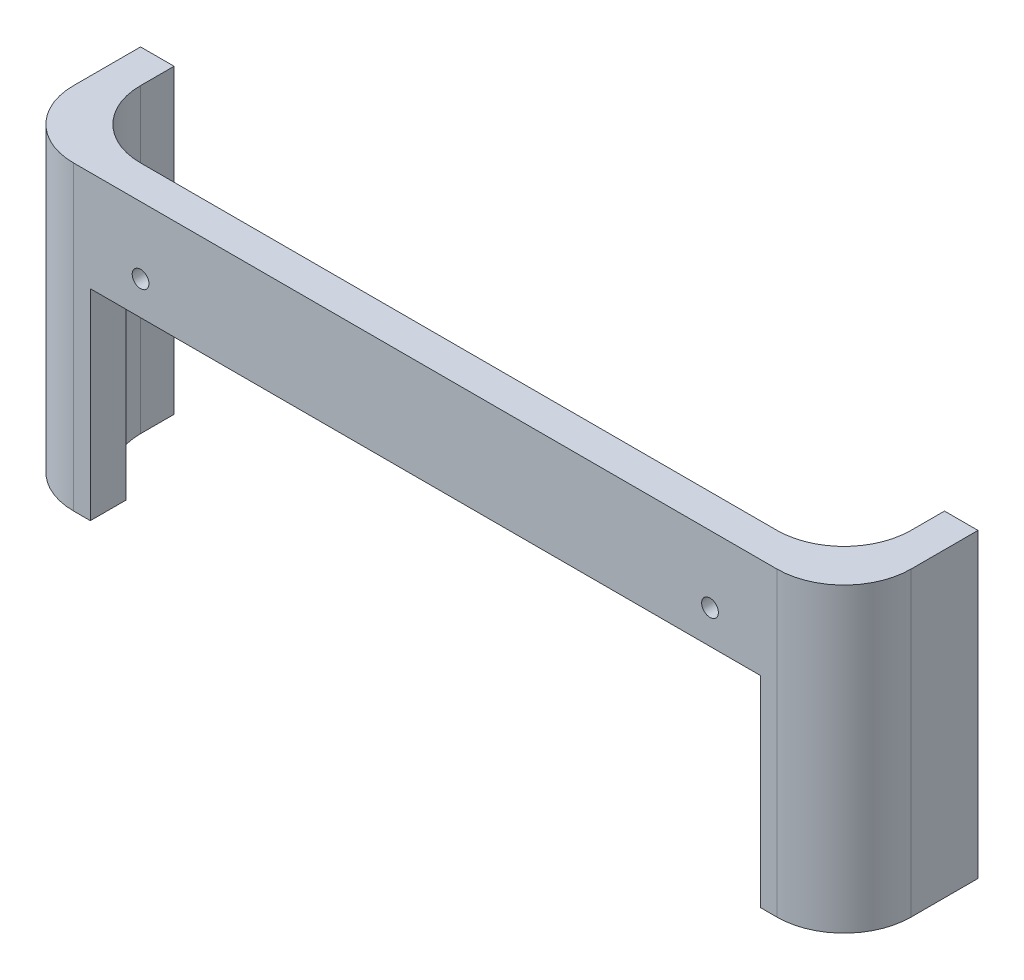
ISO-10303-21;
HEADER;
FILE_DESCRIPTION(('STEP AP214'),'2;1');
FILE_NAME('part.step','',(''),(''),'','','');
FILE_SCHEMA(('AUTOMOTIVE_DESIGN { 1 0 10303 214 1 1 1 1 }'));
ENDSEC;
DATA;
#1=APPLICATION_CONTEXT('core data for automotive mechanical design processes');
#2=APPLICATION_PROTOCOL_DEFINITION('international standard','automotive_design',2000,#1);
#3=PRODUCT_CONTEXT('',#1,'mechanical');
#4=PRODUCT('Part','Part','',(#3));
#5=PRODUCT_RELATED_PRODUCT_CATEGORY('part','',(#4));
#6=PRODUCT_DEFINITION_FORMATION('','',#4);
#7=PRODUCT_DEFINITION_CONTEXT('part definition',#1,'design');
#8=PRODUCT_DEFINITION('design','',#6,#7);
#9=PRODUCT_DEFINITION_SHAPE('','',#8);
#10=(LENGTH_UNIT() NAMED_UNIT(*) SI_UNIT(.MILLI.,.METRE.));
#11=(NAMED_UNIT(*) PLANE_ANGLE_UNIT() SI_UNIT($,.RADIAN.));
#12=(NAMED_UNIT(*) SI_UNIT($,.STERADIAN.) SOLID_ANGLE_UNIT());
#13=UNCERTAINTY_MEASURE_WITH_UNIT(LENGTH_MEASURE(1.E-05),#10,'distance_accuracy_value','');
#14=(GEOMETRIC_REPRESENTATION_CONTEXT(3) GLOBAL_UNCERTAINTY_ASSIGNED_CONTEXT((#13)) GLOBAL_UNIT_ASSIGNED_CONTEXT((#10,
#11,#12)) REPRESENTATION_CONTEXT('',''));
#15=CARTESIAN_POINT('',(0.,0.,0.));
#16=DIRECTION('',(0.,0.,1.));
#17=DIRECTION('',(1.,0.,0.));
#18=AXIS2_PLACEMENT_3D('',#15,#16,#17);
#19=CARTESIAN_POINT('',(0.,0.,0.));
#20=DIRECTION('',(0.,-1.,0.));
#21=DIRECTION('',(0.,0.,-1.));
#22=AXIS2_PLACEMENT_3D('',#19,#20,#21);
#23=PLANE('',#22);
#24=DIRECTION('',(1.,0.,0.));
#25=VECTOR('',#24,1.);
#26=CARTESIAN_POINT('',(-125.,0.,85.));
#27=LINE('',#26,#25);
#28=CARTESIAN_POINT('',(115.,0.,85.));
#29=VERTEX_POINT('',#28);
#30=CARTESIAN_POINT('',(125.,0.,85.));
#31=VERTEX_POINT('',#30);
#32=EDGE_CURVE('E55',#29,#31,#27,.T.);
#33=ORIENTED_EDGE('',*,*,#32,.T.);
#34=DIRECTION('',(0.,0.,-1.));
#35=VECTOR('',#34,1.);
#36=CARTESIAN_POINT('',(125.,0.,125.));
#37=LINE('',#36,#35);
#38=CARTESIAN_POINT('',(125.,0.,105.));
#39=VERTEX_POINT('',#38);
#40=EDGE_CURVE('E176',#39,#31,#37,.T.);
#41=ORIENTED_EDGE('',*,*,#40,.F.);
#42=CARTESIAN_POINT('',(105.,0.,105.));
#43=DIRECTION('',(0.,-1.,0.));
#44=DIRECTION('',(0.,0.,-1.));
#45=AXIS2_PLACEMENT_3D('',#42,#43,#44);
#46=CIRCLE('',#45,20.);
#47=CARTESIAN_POINT('',(105.,0.,125.));
#48=VERTEX_POINT('',#47);
#49=EDGE_CURVE('E216',#39,#48,#46,.T.);
#50=ORIENTED_EDGE('',*,*,#49,.T.);
#51=DIRECTION('',(1.,0.,0.));
#52=VECTOR('',#51,1.);
#53=CARTESIAN_POINT('',(-125.,0.,125.));
#54=LINE('',#53,#52);
#55=CARTESIAN_POINT('',(100.,0.,125.));
#56=VERTEX_POINT('',#55);
#57=EDGE_CURVE('E175',#56,#48,#54,.T.);
#58=ORIENTED_EDGE('',*,*,#57,.F.);
#59=DIRECTION('',(0.,0.,1.));
#60=VECTOR('',#59,1.);
#61=CARTESIAN_POINT('',(100.,0.,75.));
#62=LINE('',#61,#60);
#63=CARTESIAN_POINT('',(100.,0.,114.364916731037));
#64=VERTEX_POINT('',#63);
#65=EDGE_CURVE('E356',#64,#56,#62,.T.);
#66=ORIENTED_EDGE('',*,*,#65,.F.);
#67=CARTESIAN_POINT('',(95.,0.,95.));
#68=DIRECTION('',(0.,-1.,0.));
#69=DIRECTION('',(0.,0.,-1.));
#70=AXIS2_PLACEMENT_3D('',#67,#68,#69);
#71=CIRCLE('',#70,20.);
#72=CARTESIAN_POINT('',(115.,0.,95.));
#73=VERTEX_POINT('',#72);
#74=EDGE_CURVE('E257',#64,#73,#71,.F.);
#75=ORIENTED_EDGE('',*,*,#74,.T.);
#76=DIRECTION('',(0.,0.,-1.));
#77=VECTOR('',#76,1.);
#78=CARTESIAN_POINT('',(115.,0.,115.));
#79=LINE('',#78,#77);
#80=EDGE_CURVE('E304',#73,#29,#79,.T.);
#81=ORIENTED_EDGE('',*,*,#80,.T.);
#82=EDGE_LOOP('',(#33,#41,#50,#58,#66,#75,#81));
#83=FACE_BOUND('',#82,.T.);
#84=ADVANCED_FACE('F39',(#83),#23,.T.);
#85=CARTESIAN_POINT('',(0.,90.,0.));
#86=DIRECTION('',(0.,-1.,0.));
#87=DIRECTION('',(0.,0.,-1.));
#88=AXIS2_PLACEMENT_3D('',#85,#86,#87);
#89=PLANE('',#88);
#90=DIRECTION('',(0.,0.,-1.));
#91=VECTOR('',#90,1.);
#92=CARTESIAN_POINT('',(125.,90.,125.));
#93=LINE('',#92,#91);
#94=CARTESIAN_POINT('',(125.,90.,105.));
#95=VERTEX_POINT('',#94);
#96=CARTESIAN_POINT('',(125.,90.,85.));
#97=VERTEX_POINT('',#96);
#98=EDGE_CURVE('E189',#95,#97,#93,.T.);
#99=ORIENTED_EDGE('',*,*,#98,.T.);
#100=DIRECTION('',(1.,0.,0.));
#101=VECTOR('',#100,1.);
#102=CARTESIAN_POINT('',(-125.,90.,85.));
#103=LINE('',#102,#101);
#104=CARTESIAN_POINT('',(115.,90.,85.));
#105=VERTEX_POINT('',#104);
#106=EDGE_CURVE('E158',#105,#97,#103,.T.);
#107=ORIENTED_EDGE('',*,*,#106,.F.);
#108=DIRECTION('',(0.,0.,-1.));
#109=VECTOR('',#108,1.);
#110=CARTESIAN_POINT('',(115.,90.,115.));
#111=LINE('',#110,#109);
#112=CARTESIAN_POINT('',(115.,90.,95.));
#113=VERTEX_POINT('',#112);
#114=EDGE_CURVE('E270',#113,#105,#111,.T.);
#115=ORIENTED_EDGE('',*,*,#114,.F.);
#116=CARTESIAN_POINT('',(95.,90.,95.));
#117=DIRECTION('',(0.,-1.,0.));
#118=DIRECTION('',(0.,0.,-1.));
#119=AXIS2_PLACEMENT_3D('',#116,#117,#118);
#120=CIRCLE('',#119,20.);
#121=CARTESIAN_POINT('',(95.,90.,115.));
#122=VERTEX_POINT('',#121);
#123=EDGE_CURVE('E48',#113,#122,#120,.T.);
#124=ORIENTED_EDGE('',*,*,#123,.T.);
#125=DIRECTION('',(1.,0.,0.));
#126=VECTOR('',#125,1.);
#127=CARTESIAN_POINT('',(-115.,90.,115.));
#128=LINE('',#127,#126);
#129=CARTESIAN_POINT('',(-95.,90.,115.));
#130=VERTEX_POINT('',#129);
#131=EDGE_CURVE('E184',#130,#122,#128,.T.);
#132=ORIENTED_EDGE('',*,*,#131,.F.);
#133=CARTESIAN_POINT('',(-95.,90.,95.));
#134=DIRECTION('',(0.,-1.,0.));
#135=DIRECTION('',(0.,0.,-1.));
#136=AXIS2_PLACEMENT_3D('',#133,#134,#135);
#137=CIRCLE('',#136,20.);
#138=CARTESIAN_POINT('',(-115.,90.,95.));
#139=VERTEX_POINT('',#138);
#140=EDGE_CURVE('E245',#130,#139,#137,.T.);
#141=ORIENTED_EDGE('',*,*,#140,.T.);
#142=DIRECTION('',(0.,0.,1.));
#143=VECTOR('',#142,1.);
#144=CARTESIAN_POINT('',(-115.,90.,115.));
#145=LINE('',#144,#143);
#146=CARTESIAN_POINT('',(-115.,90.,85.));
#147=VERTEX_POINT('',#146);
#148=EDGE_CURVE('E279',#147,#139,#145,.T.);
#149=ORIENTED_EDGE('',*,*,#148,.F.);
#150=CARTESIAN_POINT('',(-125.,90.,85.));
#151=VERTEX_POINT('',#150);
#152=EDGE_CURVE('E62',#151,#147,#103,.T.);
#153=ORIENTED_EDGE('',*,*,#152,.F.);
#154=DIRECTION('',(0.,0.,1.));
#155=VECTOR('',#154,1.);
#156=CARTESIAN_POINT('',(-125.,90.,125.));
#157=LINE('',#156,#155);
#158=CARTESIAN_POINT('',(-125.,90.,105.));
#159=VERTEX_POINT('',#158);
#160=EDGE_CURVE('E166',#151,#159,#157,.T.);
#161=ORIENTED_EDGE('',*,*,#160,.T.);
#162=CARTESIAN_POINT('',(-105.,90.,105.));
#163=DIRECTION('',(0.,-1.,0.));
#164=DIRECTION('',(0.,0.,-1.));
#165=AXIS2_PLACEMENT_3D('',#162,#163,#164);
#166=CIRCLE('',#165,20.);
#167=CARTESIAN_POINT('',(-105.,90.,125.));
#168=VERTEX_POINT('',#167);
#169=EDGE_CURVE('E227',#159,#168,#166,.F.);
#170=ORIENTED_EDGE('',*,*,#169,.T.);
#171=DIRECTION('',(1.,0.,0.));
#172=VECTOR('',#171,1.);
#173=CARTESIAN_POINT('',(-125.,90.,125.));
#174=LINE('',#173,#172);
#175=CARTESIAN_POINT('',(105.,90.,125.));
#176=VERTEX_POINT('',#175);
#177=EDGE_CURVE('E195',#168,#176,#174,.T.);
#178=ORIENTED_EDGE('',*,*,#177,.T.);
#179=CARTESIAN_POINT('',(105.,90.,105.));
#180=DIRECTION('',(0.,-1.,0.));
#181=DIRECTION('',(0.,0.,-1.));
#182=AXIS2_PLACEMENT_3D('',#179,#180,#181);
#183=CIRCLE('',#182,20.);
#184=EDGE_CURVE('E224',#176,#95,#183,.F.);
#185=ORIENTED_EDGE('',*,*,#184,.T.);
#186=EDGE_LOOP('',(#99,#107,#115,#124,#132,#141,#149,#153,#161,#170,#178,#185));
#187=FACE_BOUND('',#186,.T.);
#188=ADVANCED_FACE('F266',(#187),#89,.F.);
#189=CARTESIAN_POINT('',(-125.,0.,85.));
#190=VERTEX_POINT('',#189);
#191=CARTESIAN_POINT('',(-115.,0.,85.));
#192=VERTEX_POINT('',#191);
#193=EDGE_CURVE('E150',#190,#192,#27,.T.);
#194=ORIENTED_EDGE('',*,*,#193,.T.);
#195=DIRECTION('',(0.,0.,1.));
#196=VECTOR('',#195,1.);
#197=CARTESIAN_POINT('',(-115.,0.,115.));
#198=LINE('',#197,#196);
#199=CARTESIAN_POINT('',(-115.,0.,95.));
#200=VERTEX_POINT('',#199);
#201=EDGE_CURVE('E300',#192,#200,#198,.T.);
#202=ORIENTED_EDGE('',*,*,#201,.T.);
#203=CARTESIAN_POINT('',(-95.,0.,95.));
#204=DIRECTION('',(0.,-1.,0.));
#205=DIRECTION('',(0.,0.,-1.));
#206=AXIS2_PLACEMENT_3D('',#203,#204,#205);
#207=CIRCLE('',#206,20.);
#208=CARTESIAN_POINT('',(-100.,0.,114.364916731037));
#209=VERTEX_POINT('',#208);
#210=EDGE_CURVE('E234',#200,#209,#207,.F.);
#211=ORIENTED_EDGE('',*,*,#210,.T.);
#212=DIRECTION('',(0.,0.,1.));
#213=VECTOR('',#212,1.);
#214=CARTESIAN_POINT('',(-100.,0.,75.));
#215=LINE('',#214,#213);
#216=CARTESIAN_POINT('',(-100.,0.,125.));
#217=VERTEX_POINT('',#216);
#218=EDGE_CURVE('E351',#209,#217,#215,.T.);
#219=ORIENTED_EDGE('',*,*,#218,.T.);
#220=CARTESIAN_POINT('',(-105.,0.,125.));
#221=VERTEX_POINT('',#220);
#222=EDGE_CURVE('E181',#221,#217,#54,.T.);
#223=ORIENTED_EDGE('',*,*,#222,.F.);
#224=CARTESIAN_POINT('',(-105.,0.,105.));
#225=DIRECTION('',(0.,-1.,0.));
#226=DIRECTION('',(0.,0.,-1.));
#227=AXIS2_PLACEMENT_3D('',#224,#225,#226);
#228=CIRCLE('',#227,20.);
#229=CARTESIAN_POINT('',(-125.,0.,105.));
#230=VERTEX_POINT('',#229);
#231=EDGE_CURVE('E172',#221,#230,#228,.T.);
#232=ORIENTED_EDGE('',*,*,#231,.T.);
#233=DIRECTION('',(0.,0.,1.));
#234=VECTOR('',#233,1.);
#235=CARTESIAN_POINT('',(-125.,0.,125.));
#236=LINE('',#235,#234);
#237=EDGE_CURVE('E164',#190,#230,#236,.T.);
#238=ORIENTED_EDGE('',*,*,#237,.F.);
#239=EDGE_LOOP('',(#194,#202,#211,#219,#223,#232,#238));
#240=FACE_BOUND('',#239,.T.);
#241=ADVANCED_FACE('F170',(#240),#23,.T.);
#242=CARTESIAN_POINT('',(125.,90.,125.));
#243=DIRECTION('',(-1.,0.,0.));
#244=DIRECTION('',(0.,0.,1.));
#245=AXIS2_PLACEMENT_3D('',#242,#243,#244);
#246=PLANE('',#245);
#247=ORIENTED_EDGE('',*,*,#40,.T.);
#248=DIRECTION('',(0.,1.,0.));
#249=VECTOR('',#248,1.);
#250=CARTESIAN_POINT('',(125.,90.,85.));
#251=LINE('',#250,#249);
#252=EDGE_CURVE('E338',#31,#97,#251,.T.);
#253=ORIENTED_EDGE('',*,*,#252,.T.);
#254=ORIENTED_EDGE('',*,*,#98,.F.);
#255=DIRECTION('',(0.,-1.,0.));
#256=VECTOR('',#255,1.);
#257=CARTESIAN_POINT('',(125.,90.,105.));
#258=LINE('',#257,#256);
#259=EDGE_CURVE('E230',#95,#39,#258,.T.);
#260=ORIENTED_EDGE('',*,*,#259,.T.);
#261=EDGE_LOOP('',(#247,#253,#254,#260));
#262=FACE_BOUND('',#261,.T.);
#263=ADVANCED_FACE('F327',(#262),#246,.F.);
#264=CARTESIAN_POINT('',(-125.,90.,125.));
#265=DIRECTION('',(1.,0.,0.));
#266=DIRECTION('',(0.,0.,-1.));
#267=AXIS2_PLACEMENT_3D('',#264,#265,#266);
#268=PLANE('',#267);
#269=ORIENTED_EDGE('',*,*,#160,.F.);
#270=DIRECTION('',(0.,-1.,0.));
#271=VECTOR('',#270,1.);
#272=CARTESIAN_POINT('',(-125.,0.,85.));
#273=LINE('',#272,#271);
#274=EDGE_CURVE('E153',#151,#190,#273,.T.);
#275=ORIENTED_EDGE('',*,*,#274,.T.);
#276=ORIENTED_EDGE('',*,*,#237,.T.);
#277=DIRECTION('',(0.,-1.,0.));
#278=VECTOR('',#277,1.);
#279=CARTESIAN_POINT('',(-125.,90.,105.));
#280=LINE('',#279,#278);
#281=EDGE_CURVE('E221',#230,#159,#280,.F.);
#282=ORIENTED_EDGE('',*,*,#281,.T.);
#283=EDGE_LOOP('',(#269,#275,#276,#282));
#284=FACE_BOUND('',#283,.T.);
#285=ADVANCED_FACE('F162',(#284),#268,.F.);
#286=CARTESIAN_POINT('',(-125.,90.,125.));
#287=DIRECTION('',(0.,0.,-1.));
#288=DIRECTION('',(-1.,0.,0.));
#289=AXIS2_PLACEMENT_3D('',#286,#287,#288);
#290=PLANE('',#289);
#291=CARTESIAN_POINT('',(-85.,70.,125.));
#292=DIRECTION('',(0.,0.,1.));
#293=DIRECTION('',(1.,0.,0.));
#294=AXIS2_PLACEMENT_3D('',#291,#292,#293);
#295=CIRCLE('',#294,2.50000000000001);
#296=CARTESIAN_POINT('',(-82.5,70.,125.));
#297=VERTEX_POINT('',#296);
#298=EDGE_CURVE('E441',#297,#297,#295,.T.);
#299=ORIENTED_EDGE('',*,*,#298,.F.);
#300=EDGE_LOOP('',(#299));
#301=FACE_BOUND('',#300,.T.);
#302=CARTESIAN_POINT('',(85.,70.,125.));
#303=DIRECTION('',(0.,0.,1.));
#304=DIRECTION('',(1.,0.,0.));
#305=AXIS2_PLACEMENT_3D('',#302,#303,#304);
#306=CIRCLE('',#305,2.50000000000001);
#307=CARTESIAN_POINT('',(87.5,70.,125.));
#308=VERTEX_POINT('',#307);
#309=EDGE_CURVE('E449',#308,#308,#306,.T.);
#310=ORIENTED_EDGE('',*,*,#309,.F.);
#311=EDGE_LOOP('',(#310));
#312=FACE_BOUND('',#311,.T.);
#313=ORIENTED_EDGE('',*,*,#177,.F.);
#314=DIRECTION('',(0.,-1.,0.));
#315=VECTOR('',#314,1.);
#316=CARTESIAN_POINT('',(-105.,90.,125.));
#317=LINE('',#316,#315);
#318=EDGE_CURVE('E212',#168,#221,#317,.T.);
#319=ORIENTED_EDGE('',*,*,#318,.T.);
#320=ORIENTED_EDGE('',*,*,#222,.T.);
#321=DIRECTION('',(0.,-1.,0.));
#322=VECTOR('',#321,1.);
#323=CARTESIAN_POINT('',(-100.,60.,125.));
#324=LINE('',#323,#322);
#325=CARTESIAN_POINT('',(-100.,60.,125.));
#326=VERTEX_POINT('',#325);
#327=EDGE_CURVE('E341',#326,#217,#324,.T.);
#328=ORIENTED_EDGE('',*,*,#327,.F.);
#329=DIRECTION('',(-1.,0.,0.));
#330=VECTOR('',#329,1.);
#331=CARTESIAN_POINT('',(-100.,60.,125.));
#332=LINE('',#331,#330);
#333=CARTESIAN_POINT('',(100.,60.,125.));
#334=VERTEX_POINT('',#333);
#335=EDGE_CURVE('E348',#334,#326,#332,.T.);
#336=ORIENTED_EDGE('',*,*,#335,.F.);
#337=DIRECTION('',(0.,1.,0.));
#338=VECTOR('',#337,1.);
#339=CARTESIAN_POINT('',(100.,60.,125.));
#340=LINE('',#339,#338);
#341=EDGE_CURVE('E345',#56,#334,#340,.T.);
#342=ORIENTED_EDGE('',*,*,#341,.F.);
#343=ORIENTED_EDGE('',*,*,#57,.T.);
#344=DIRECTION('',(0.,-1.,0.));
#345=VECTOR('',#344,1.);
#346=CARTESIAN_POINT('',(105.,90.,125.));
#347=LINE('',#346,#345);
#348=EDGE_CURVE('E209',#48,#176,#347,.F.);
#349=ORIENTED_EDGE('',*,*,#348,.T.);
#350=EDGE_LOOP('',(#313,#319,#320,#328,#336,#342,#343,#349));
#351=FACE_BOUND('',#350,.T.);
#352=ADVANCED_FACE('F364',(#301,#312,#351),#290,.F.);
#353=CARTESIAN_POINT('',(115.,90.,115.));
#354=DIRECTION('',(-1.,0.,0.));
#355=DIRECTION('',(0.,0.,1.));
#356=AXIS2_PLACEMENT_3D('',#353,#354,#355);
#357=PLANE('',#356);
#358=DIRECTION('',(0.,1.,0.));
#359=VECTOR('',#358,1.);
#360=CARTESIAN_POINT('',(115.,90.,85.));
#361=LINE('',#360,#359);
#362=EDGE_CURVE('E335',#29,#105,#361,.T.);
#363=ORIENTED_EDGE('',*,*,#362,.F.);
#364=ORIENTED_EDGE('',*,*,#80,.F.);
#365=DIRECTION('',(0.,-1.,0.));
#366=VECTOR('',#365,1.);
#367=CARTESIAN_POINT('',(115.,90.,95.));
#368=LINE('',#367,#366);
#369=EDGE_CURVE('E206',#73,#113,#368,.F.);
#370=ORIENTED_EDGE('',*,*,#369,.T.);
#371=ORIENTED_EDGE('',*,*,#114,.T.);
#372=EDGE_LOOP('',(#363,#364,#370,#371));
#373=FACE_BOUND('',#372,.T.);
#374=ADVANCED_FACE('F412',(#373),#357,.T.);
#375=CARTESIAN_POINT('',(-115.,90.,115.));
#376=DIRECTION('',(1.,0.,0.));
#377=DIRECTION('',(0.,0.,-1.));
#378=AXIS2_PLACEMENT_3D('',#375,#376,#377);
#379=PLANE('',#378);
#380=DIRECTION('',(0.,-1.,0.));
#381=VECTOR('',#380,1.);
#382=CARTESIAN_POINT('',(-115.,90.,85.));
#383=LINE('',#382,#381);
#384=EDGE_CURVE('E11',#147,#192,#383,.T.);
#385=ORIENTED_EDGE('',*,*,#384,.F.);
#386=ORIENTED_EDGE('',*,*,#148,.T.);
#387=DIRECTION('',(0.,-1.,0.));
#388=VECTOR('',#387,1.);
#389=CARTESIAN_POINT('',(-115.,0.,95.));
#390=LINE('',#389,#388);
#391=EDGE_CURVE('E194',#139,#200,#390,.T.);
#392=ORIENTED_EDGE('',*,*,#391,.T.);
#393=ORIENTED_EDGE('',*,*,#201,.F.);
#394=EDGE_LOOP('',(#385,#386,#392,#393));
#395=FACE_BOUND('',#394,.T.);
#396=ADVANCED_FACE('F408',(#395),#379,.T.);
#397=CARTESIAN_POINT('',(-115.,90.,115.));
#398=DIRECTION('',(0.,0.,-1.));
#399=DIRECTION('',(-1.,0.,0.));
#400=AXIS2_PLACEMENT_3D('',#397,#398,#399);
#401=PLANE('',#400);
#402=CARTESIAN_POINT('',(-85.,70.,115.));
#403=DIRECTION('',(0.,0.,1.));
#404=DIRECTION('',(1.,0.,0.));
#405=AXIS2_PLACEMENT_3D('',#402,#403,#404);
#406=CIRCLE('',#405,2.50000000000001);
#407=CARTESIAN_POINT('',(-82.5,70.,115.));
#408=VERTEX_POINT('',#407);
#409=EDGE_CURVE('E168',#408,#408,#406,.T.);
#410=ORIENTED_EDGE('',*,*,#409,.T.);
#411=EDGE_LOOP('',(#410));
#412=FACE_BOUND('',#411,.T.);
#413=CARTESIAN_POINT('',(85.,70.,115.));
#414=DIRECTION('',(0.,0.,1.));
#415=DIRECTION('',(1.,0.,0.));
#416=AXIS2_PLACEMENT_3D('',#413,#414,#415);
#417=CIRCLE('',#416,2.50000000000001);
#418=CARTESIAN_POINT('',(87.5,70.,115.));
#419=VERTEX_POINT('',#418);
#420=EDGE_CURVE('E443',#419,#419,#417,.T.);
#421=ORIENTED_EDGE('',*,*,#420,.T.);
#422=EDGE_LOOP('',(#421));
#423=FACE_BOUND('',#422,.T.);
#424=DIRECTION('',(1.,0.,0.));
#425=VECTOR('',#424,1.);
#426=CARTESIAN_POINT('',(-115.,60.,115.));
#427=LINE('',#426,#425);
#428=CARTESIAN_POINT('',(-95.,60.,115.));
#429=VERTEX_POINT('',#428);
#430=CARTESIAN_POINT('',(95.,60.,115.));
#431=VERTEX_POINT('',#430);
#432=EDGE_CURVE('E190',#429,#431,#427,.T.);
#433=ORIENTED_EDGE('',*,*,#432,.F.);
#434=DIRECTION('',(0.,-1.,0.));
#435=VECTOR('',#434,1.);
#436=CARTESIAN_POINT('',(-95.,90.,115.));
#437=LINE('',#436,#435);
#438=EDGE_CURVE('E203',#429,#130,#437,.F.);
#439=ORIENTED_EDGE('',*,*,#438,.T.);
#440=ORIENTED_EDGE('',*,*,#131,.T.);
#441=DIRECTION('',(0.,-1.,0.));
#442=VECTOR('',#441,1.);
#443=CARTESIAN_POINT('',(95.,0.,115.));
#444=LINE('',#443,#442);
#445=EDGE_CURVE('E199',#122,#431,#444,.T.);
#446=ORIENTED_EDGE('',*,*,#445,.T.);
#447=EDGE_LOOP('',(#433,#439,#440,#446));
#448=FACE_BOUND('',#447,.T.);
#449=ADVANCED_FACE('F276',(#412,#423,#448),#401,.T.);
#450=CARTESIAN_POINT('',(-100.,60.,75.));
#451=DIRECTION('',(-1.,0.,0.));
#452=DIRECTION('',(0.,0.,1.));
#453=AXIS2_PLACEMENT_3D('',#450,#451,#452);
#454=PLANE('',#453);
#455=ORIENTED_EDGE('',*,*,#218,.F.);
#456=DIRECTION('',(0.,1.,0.));
#457=VECTOR('',#456,1.);
#458=CARTESIAN_POINT('',(-100.,0.,114.364916731037));
#459=LINE('',#458,#457);
#460=CARTESIAN_POINT('',(-100.,60.,114.364916731037));
#461=VERTEX_POINT('',#460);
#462=EDGE_CURVE('E238',#209,#461,#459,.T.);
#463=ORIENTED_EDGE('',*,*,#462,.T.);
#464=DIRECTION('',(0.,0.,1.));
#465=VECTOR('',#464,1.);
#466=CARTESIAN_POINT('',(-100.,60.,75.));
#467=LINE('',#466,#465);
#468=EDGE_CURVE('E308',#461,#326,#467,.T.);
#469=ORIENTED_EDGE('',*,*,#468,.T.);
#470=ORIENTED_EDGE('',*,*,#327,.T.);
#471=EDGE_LOOP('',(#455,#463,#469,#470));
#472=FACE_BOUND('',#471,.T.);
#473=ADVANCED_FACE('F361',(#472),#454,.F.);
#474=CARTESIAN_POINT('',(-100.,60.,75.));
#475=DIRECTION('',(0.,1.,0.));
#476=DIRECTION('',(0.,0.,1.));
#477=AXIS2_PLACEMENT_3D('',#474,#475,#476);
#478=PLANE('',#477);
#479=ORIENTED_EDGE('',*,*,#468,.F.);
#480=CARTESIAN_POINT('',(-95.,60.,95.));
#481=DIRECTION('',(0.,1.,0.));
#482=DIRECTION('',(0.,0.,1.));
#483=AXIS2_PLACEMENT_3D('',#480,#481,#482);
#484=CIRCLE('',#483,20.);
#485=EDGE_CURVE('E242',#461,#429,#484,.T.);
#486=ORIENTED_EDGE('',*,*,#485,.T.);
#487=ORIENTED_EDGE('',*,*,#432,.T.);
#488=CARTESIAN_POINT('',(95.,60.,95.));
#489=DIRECTION('',(0.,1.,0.));
#490=DIRECTION('',(0.,0.,1.));
#491=AXIS2_PLACEMENT_3D('',#488,#489,#490);
#492=CIRCLE('',#491,20.);
#493=CARTESIAN_POINT('',(100.,60.,114.364916731037));
#494=VERTEX_POINT('',#493);
#495=EDGE_CURVE('E249',#431,#494,#492,.T.);
#496=ORIENTED_EDGE('',*,*,#495,.T.);
#497=DIRECTION('',(0.,0.,1.));
#498=VECTOR('',#497,1.);
#499=CARTESIAN_POINT('',(100.,60.,75.));
#500=LINE('',#499,#498);
#501=EDGE_CURVE('E287',#494,#334,#500,.T.);
#502=ORIENTED_EDGE('',*,*,#501,.T.);
#503=ORIENTED_EDGE('',*,*,#335,.T.);
#504=EDGE_LOOP('',(#479,#486,#487,#496,#502,#503));
#505=FACE_BOUND('',#504,.T.);
#506=ADVANCED_FACE('F285',(#505),#478,.F.);
#507=CARTESIAN_POINT('',(100.,60.,75.));
#508=DIRECTION('',(1.,0.,0.));
#509=DIRECTION('',(0.,0.,-1.));
#510=AXIS2_PLACEMENT_3D('',#507,#508,#509);
#511=PLANE('',#510);
#512=ORIENTED_EDGE('',*,*,#501,.F.);
#513=DIRECTION('',(0.,1.,0.));
#514=VECTOR('',#513,1.);
#515=CARTESIAN_POINT('',(100.,60.,114.364916731037));
#516=LINE('',#515,#514);
#517=EDGE_CURVE('E253',#494,#64,#516,.F.);
#518=ORIENTED_EDGE('',*,*,#517,.T.);
#519=ORIENTED_EDGE('',*,*,#65,.T.);
#520=ORIENTED_EDGE('',*,*,#341,.T.);
#521=EDGE_LOOP('',(#512,#518,#519,#520));
#522=FACE_BOUND('',#521,.T.);
#523=ADVANCED_FACE('F392',(#522),#511,.F.);
#524=CARTESIAN_POINT('',(-95.,90.,95.));
#525=DIRECTION('',(0.,1.,0.));
#526=DIRECTION('',(0.,0.,1.));
#527=AXIS2_PLACEMENT_3D('',#524,#525,#526);
#528=CYLINDRICAL_SURFACE('',#527,20.);
#529=ORIENTED_EDGE('',*,*,#140,.F.);
#530=ORIENTED_EDGE('',*,*,#438,.F.);
#531=ORIENTED_EDGE('',*,*,#485,.F.);
#532=ORIENTED_EDGE('',*,*,#462,.F.);
#533=ORIENTED_EDGE('',*,*,#210,.F.);
#534=ORIENTED_EDGE('',*,*,#391,.F.);
#535=EDGE_LOOP('',(#529,#530,#531,#532,#533,#534));
#536=FACE_BOUND('',#535,.T.);
#537=ADVANCED_FACE('F291',(#536),#528,.F.);
#538=CARTESIAN_POINT('',(95.,90.,95.));
#539=DIRECTION('',(0.,1.,0.));
#540=DIRECTION('',(0.,0.,1.));
#541=AXIS2_PLACEMENT_3D('',#538,#539,#540);
#542=CYLINDRICAL_SURFACE('',#541,20.);
#543=ORIENTED_EDGE('',*,*,#123,.F.);
#544=ORIENTED_EDGE('',*,*,#369,.F.);
#545=ORIENTED_EDGE('',*,*,#74,.F.);
#546=ORIENTED_EDGE('',*,*,#517,.F.);
#547=ORIENTED_EDGE('',*,*,#495,.F.);
#548=ORIENTED_EDGE('',*,*,#445,.F.);
#549=EDGE_LOOP('',(#543,#544,#545,#546,#547,#548));
#550=FACE_BOUND('',#549,.T.);
#551=ADVANCED_FACE('F281',(#550),#542,.F.);
#552=CARTESIAN_POINT('',(-105.,90.,105.));
#553=DIRECTION('',(0.,-1.,0.));
#554=DIRECTION('',(0.,0.,-1.));
#555=AXIS2_PLACEMENT_3D('',#552,#553,#554);
#556=CYLINDRICAL_SURFACE('',#555,20.);
#557=ORIENTED_EDGE('',*,*,#169,.F.);
#558=ORIENTED_EDGE('',*,*,#281,.F.);
#559=ORIENTED_EDGE('',*,*,#231,.F.);
#560=ORIENTED_EDGE('',*,*,#318,.F.);
#561=EDGE_LOOP('',(#557,#558,#559,#560));
#562=FACE_BOUND('',#561,.T.);
#563=ADVANCED_FACE('F367',(#562),#556,.T.);
#564=CARTESIAN_POINT('',(105.,90.,105.));
#565=DIRECTION('',(0.,-1.,0.));
#566=DIRECTION('',(0.,0.,-1.));
#567=AXIS2_PLACEMENT_3D('',#564,#565,#566);
#568=CYLINDRICAL_SURFACE('',#567,20.);
#569=ORIENTED_EDGE('',*,*,#184,.F.);
#570=ORIENTED_EDGE('',*,*,#348,.F.);
#571=ORIENTED_EDGE('',*,*,#49,.F.);
#572=ORIENTED_EDGE('',*,*,#259,.F.);
#573=EDGE_LOOP('',(#569,#570,#571,#572));
#574=FACE_BOUND('',#573,.T.);
#575=ADVANCED_FACE('F41',(#574),#568,.T.);
#576=CARTESIAN_POINT('',(-125.,0.,85.));
#577=DIRECTION('',(0.,0.,1.));
#578=DIRECTION('',(1.,0.,0.));
#579=AXIS2_PLACEMENT_3D('',#576,#577,#578);
#580=PLANE('',#579);
#581=ORIENTED_EDGE('',*,*,#384,.T.);
#582=ORIENTED_EDGE('',*,*,#193,.F.);
#583=ORIENTED_EDGE('',*,*,#274,.F.);
#584=ORIENTED_EDGE('',*,*,#152,.T.);
#585=EDGE_LOOP('',(#581,#582,#583,#584));
#586=FACE_BOUND('',#585,.T.);
#587=ADVANCED_FACE('F152',(#586),#580,.F.);
#588=ORIENTED_EDGE('',*,*,#32,.F.);
#589=ORIENTED_EDGE('',*,*,#362,.T.);
#590=ORIENTED_EDGE('',*,*,#106,.T.);
#591=ORIENTED_EDGE('',*,*,#252,.F.);
#592=EDGE_LOOP('',(#588,#589,#590,#591));
#593=FACE_BOUND('',#592,.T.);
#594=ADVANCED_FACE('F419',(#593),#580,.F.);
#595=CARTESIAN_POINT('',(85.,70.,115.));
#596=DIRECTION('',(0.,0.,1.));
#597=DIRECTION('',(1.,0.,0.));
#598=AXIS2_PLACEMENT_3D('',#595,#596,#597);
#599=CYLINDRICAL_SURFACE('',#598,2.50000000000001);
#600=ORIENTED_EDGE('',*,*,#420,.F.);
#601=EDGE_LOOP('',(#600));
#602=FACE_BOUND('',#601,.T.);
#603=ORIENTED_EDGE('',*,*,#309,.T.);
#604=EDGE_LOOP('',(#603));
#605=FACE_BOUND('',#604,.T.);
#606=ADVANCED_FACE('F423',(#602,#605),#599,.F.);
#607=CARTESIAN_POINT('',(-85.,70.,115.));
#608=DIRECTION('',(0.,0.,1.));
#609=DIRECTION('',(1.,0.,0.));
#610=AXIS2_PLACEMENT_3D('',#607,#608,#609);
#611=CYLINDRICAL_SURFACE('',#610,2.50000000000001);
#612=ORIENTED_EDGE('',*,*,#409,.F.);
#613=EDGE_LOOP('',(#612));
#614=FACE_BOUND('',#613,.T.);
#615=ORIENTED_EDGE('',*,*,#298,.T.);
#616=EDGE_LOOP('',(#615));
#617=FACE_BOUND('',#616,.T.);
#618=ADVANCED_FACE('F428',(#614,#617),#611,.F.);
#619=CLOSED_SHELL('',(#84,#188,#241,#263,#285,#352,#374,#396,#449,#473,#506,#523,#537,#551,#563,
#575,#587,#594,#606,#618));
#620=MANIFOLD_SOLID_BREP('B2',#619);
#621=ADVANCED_BREP_SHAPE_REPRESENTATION('',(#18,#620),#14);
#622=SHAPE_DEFINITION_REPRESENTATION(#9,#621);
ENDSEC;
END-ISO-10303-21;
